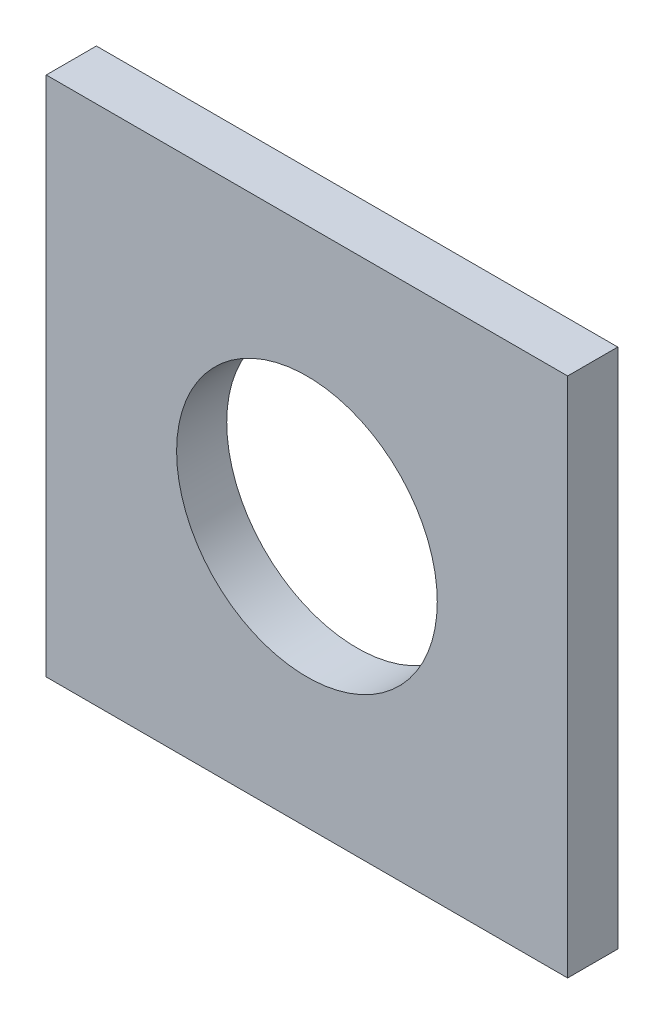
ISO-10303-21;
HEADER;
FILE_DESCRIPTION(('STEP AP214'),'2;1');
FILE_NAME('part.step','',(''),(''),'','','');
FILE_SCHEMA(('AUTOMOTIVE_DESIGN { 1 0 10303 214 1 1 1 1 }'));
ENDSEC;
DATA;
#1=APPLICATION_CONTEXT('core data for automotive mechanical design processes');
#2=APPLICATION_PROTOCOL_DEFINITION('international standard','automotive_design',2000,#1);
#3=PRODUCT_CONTEXT('',#1,'mechanical');
#4=PRODUCT('Part','Part','',(#3));
#5=PRODUCT_RELATED_PRODUCT_CATEGORY('part','',(#4));
#6=PRODUCT_DEFINITION_FORMATION('','',#4);
#7=PRODUCT_DEFINITION_CONTEXT('part definition',#1,'design');
#8=PRODUCT_DEFINITION('design','',#6,#7);
#9=PRODUCT_DEFINITION_SHAPE('','',#8);
#10=(LENGTH_UNIT() NAMED_UNIT(*) SI_UNIT(.MILLI.,.METRE.));
#11=(NAMED_UNIT(*) PLANE_ANGLE_UNIT() SI_UNIT($,.RADIAN.));
#12=(NAMED_UNIT(*) SI_UNIT($,.STERADIAN.) SOLID_ANGLE_UNIT());
#13=UNCERTAINTY_MEASURE_WITH_UNIT(LENGTH_MEASURE(1.E-05),#10,'distance_accuracy_value','');
#14=(GEOMETRIC_REPRESENTATION_CONTEXT(3) GLOBAL_UNCERTAINTY_ASSIGNED_CONTEXT((#13)) GLOBAL_UNIT_ASSIGNED_CONTEXT((#10,
#11,#12)) REPRESENTATION_CONTEXT('',''));
#15=CARTESIAN_POINT('',(0.,0.,0.));
#16=DIRECTION('',(0.,0.,1.));
#17=DIRECTION('',(1.,0.,0.));
#18=AXIS2_PLACEMENT_3D('',#15,#16,#17);
#19=CARTESIAN_POINT('',(0.,0.,7.9375));
#20=DIRECTION('',(0.,0.,-1.));
#21=DIRECTION('',(-1.,0.,0.));
#22=AXIS2_PLACEMENT_3D('',#19,#20,#21);
#23=PLANE('',#22);
#24=DIRECTION('',(0.,1.,0.));
#25=VECTOR('',#24,1.);
#26=CARTESIAN_POINT('',(41.275,-41.275,7.9375));
#27=LINE('',#26,#25);
#28=CARTESIAN_POINT('',(41.275,-41.275,7.9375));
#29=VERTEX_POINT('',#28);
#30=CARTESIAN_POINT('',(41.275,41.275,7.9375));
#31=VERTEX_POINT('',#30);
#32=EDGE_CURVE('E91',#29,#31,#27,.T.);
#33=ORIENTED_EDGE('',*,*,#32,.T.);
#34=DIRECTION('',(-1.,0.,0.));
#35=VECTOR('',#34,1.);
#36=CARTESIAN_POINT('',(-41.275,41.275,7.9375));
#37=LINE('',#36,#35);
#38=CARTESIAN_POINT('',(-41.275,41.275,7.9375));
#39=VERTEX_POINT('',#38);
#40=EDGE_CURVE('E86',#31,#39,#37,.T.);
#41=ORIENTED_EDGE('',*,*,#40,.T.);
#42=DIRECTION('',(0.,-1.,0.));
#43=VECTOR('',#42,1.);
#44=CARTESIAN_POINT('',(-41.275,-41.275,7.9375));
#45=LINE('',#44,#43);
#46=CARTESIAN_POINT('',(-41.275,-41.275,7.9375));
#47=VERTEX_POINT('',#46);
#48=EDGE_CURVE('E89',#39,#47,#45,.T.);
#49=ORIENTED_EDGE('',*,*,#48,.T.);
#50=DIRECTION('',(1.,0.,0.));
#51=VECTOR('',#50,1.);
#52=CARTESIAN_POINT('',(-41.275,-41.275,7.9375));
#53=LINE('',#52,#51);
#54=EDGE_CURVE('E56',#47,#29,#53,.T.);
#55=ORIENTED_EDGE('',*,*,#54,.T.);
#56=EDGE_LOOP('',(#33,#41,#49,#55));
#57=FACE_BOUND('',#56,.T.);
#58=CARTESIAN_POINT('',(0.,0.,7.9375));
#59=DIRECTION('',(0.,0.,1.));
#60=DIRECTION('',(1.,0.,0.));
#61=AXIS2_PLACEMENT_3D('',#58,#59,#60);
#62=CIRCLE('',#61,20.6375);
#63=CARTESIAN_POINT('',(20.6375,0.,7.9375));
#64=VERTEX_POINT('',#63);
#65=EDGE_CURVE('E106',#64,#64,#62,.T.);
#66=ORIENTED_EDGE('',*,*,#65,.F.);
#67=EDGE_LOOP('',(#66));
#68=FACE_BOUND('',#67,.T.);
#69=ADVANCED_FACE('F39',(#57,#68),#23,.F.);
#70=CARTESIAN_POINT('',(0.,0.,0.));
#71=DIRECTION('',(0.,0.,-1.));
#72=DIRECTION('',(-1.,0.,0.));
#73=AXIS2_PLACEMENT_3D('',#70,#71,#72);
#74=PLANE('',#73);
#75=DIRECTION('',(0.,1.,0.));
#76=VECTOR('',#75,1.);
#77=CARTESIAN_POINT('',(41.275,-41.275,0.));
#78=LINE('',#77,#76);
#79=CARTESIAN_POINT('',(41.275,-41.275,0.));
#80=VERTEX_POINT('',#79);
#81=CARTESIAN_POINT('',(41.275,41.275,0.));
#82=VERTEX_POINT('',#81);
#83=EDGE_CURVE('E103',#80,#82,#78,.T.);
#84=ORIENTED_EDGE('',*,*,#83,.F.);
#85=DIRECTION('',(1.,0.,0.));
#86=VECTOR('',#85,1.);
#87=CARTESIAN_POINT('',(-41.275,-41.275,0.));
#88=LINE('',#87,#86);
#89=CARTESIAN_POINT('',(-41.275,-41.275,0.));
#90=VERTEX_POINT('',#89);
#91=EDGE_CURVE('E79',#90,#80,#88,.T.);
#92=ORIENTED_EDGE('',*,*,#91,.F.);
#93=DIRECTION('',(0.,-1.,0.));
#94=VECTOR('',#93,1.);
#95=CARTESIAN_POINT('',(-41.275,-41.275,0.));
#96=LINE('',#95,#94);
#97=CARTESIAN_POINT('',(-41.275,41.275,0.));
#98=VERTEX_POINT('',#97);
#99=EDGE_CURVE('E73',#98,#90,#96,.T.);
#100=ORIENTED_EDGE('',*,*,#99,.F.);
#101=DIRECTION('',(-1.,0.,0.));
#102=VECTOR('',#101,1.);
#103=CARTESIAN_POINT('',(-41.275,41.275,0.));
#104=LINE('',#103,#102);
#105=EDGE_CURVE('E95',#82,#98,#104,.T.);
#106=ORIENTED_EDGE('',*,*,#105,.F.);
#107=EDGE_LOOP('',(#84,#92,#100,#106));
#108=FACE_BOUND('',#107,.T.);
#109=CARTESIAN_POINT('',(0.,0.,0.));
#110=DIRECTION('',(0.,0.,1.));
#111=DIRECTION('',(1.,0.,0.));
#112=AXIS2_PLACEMENT_3D('',#109,#110,#111);
#113=CIRCLE('',#112,20.6375);
#114=CARTESIAN_POINT('',(20.6375,0.,0.));
#115=VERTEX_POINT('',#114);
#116=EDGE_CURVE('E118',#115,#115,#113,.T.);
#117=ORIENTED_EDGE('',*,*,#116,.T.);
#118=EDGE_LOOP('',(#117));
#119=FACE_BOUND('',#118,.T.);
#120=ADVANCED_FACE('F114',(#108,#119),#74,.T.);
#121=CARTESIAN_POINT('',(41.275,-41.275,7.9375));
#122=DIRECTION('',(-1.,0.,0.));
#123=DIRECTION('',(0.,0.,1.));
#124=AXIS2_PLACEMENT_3D('',#121,#122,#123);
#125=PLANE('',#124);
#126=ORIENTED_EDGE('',*,*,#83,.T.);
#127=DIRECTION('',(0.,0.,-1.));
#128=VECTOR('',#127,1.);
#129=CARTESIAN_POINT('',(41.275,41.275,7.9375));
#130=LINE('',#129,#128);
#131=EDGE_CURVE('E11',#31,#82,#130,.T.);
#132=ORIENTED_EDGE('',*,*,#131,.F.);
#133=ORIENTED_EDGE('',*,*,#32,.F.);
#134=DIRECTION('',(0.,0.,-1.));
#135=VECTOR('',#134,1.);
#136=CARTESIAN_POINT('',(41.275,-41.275,7.9375));
#137=LINE('',#136,#135);
#138=EDGE_CURVE('E99',#29,#80,#137,.T.);
#139=ORIENTED_EDGE('',*,*,#138,.T.);
#140=EDGE_LOOP('',(#126,#132,#133,#139));
#141=FACE_BOUND('',#140,.T.);
#142=ADVANCED_FACE('F41',(#141),#125,.F.);
#143=CARTESIAN_POINT('',(-41.275,41.275,7.9375));
#144=DIRECTION('',(0.,-1.,0.));
#145=DIRECTION('',(0.,0.,-1.));
#146=AXIS2_PLACEMENT_3D('',#143,#144,#145);
#147=PLANE('',#146);
#148=ORIENTED_EDGE('',*,*,#105,.T.);
#149=DIRECTION('',(0.,0.,-1.));
#150=VECTOR('',#149,1.);
#151=CARTESIAN_POINT('',(-41.275,41.275,7.9375));
#152=LINE('',#151,#150);
#153=EDGE_CURVE('E48',#39,#98,#152,.T.);
#154=ORIENTED_EDGE('',*,*,#153,.F.);
#155=ORIENTED_EDGE('',*,*,#40,.F.);
#156=ORIENTED_EDGE('',*,*,#131,.T.);
#157=EDGE_LOOP('',(#148,#154,#155,#156));
#158=FACE_BOUND('',#157,.T.);
#159=ADVANCED_FACE('F94',(#158),#147,.F.);
#160=CARTESIAN_POINT('',(-41.275,-41.275,7.9375));
#161=DIRECTION('',(1.,0.,0.));
#162=DIRECTION('',(0.,0.,-1.));
#163=AXIS2_PLACEMENT_3D('',#160,#161,#162);
#164=PLANE('',#163);
#165=ORIENTED_EDGE('',*,*,#99,.T.);
#166=DIRECTION('',(0.,0.,-1.));
#167=VECTOR('',#166,1.);
#168=CARTESIAN_POINT('',(-41.275,-41.275,7.9375));
#169=LINE('',#168,#167);
#170=EDGE_CURVE('E96',#47,#90,#169,.T.);
#171=ORIENTED_EDGE('',*,*,#170,.F.);
#172=ORIENTED_EDGE('',*,*,#48,.F.);
#173=ORIENTED_EDGE('',*,*,#153,.T.);
#174=EDGE_LOOP('',(#165,#171,#172,#173));
#175=FACE_BOUND('',#174,.T.);
#176=ADVANCED_FACE('F97',(#175),#164,.F.);
#177=CARTESIAN_POINT('',(-41.275,-41.275,7.9375));
#178=DIRECTION('',(0.,1.,0.));
#179=DIRECTION('',(0.,0.,1.));
#180=AXIS2_PLACEMENT_3D('',#177,#178,#179);
#181=PLANE('',#180);
#182=ORIENTED_EDGE('',*,*,#91,.T.);
#183=ORIENTED_EDGE('',*,*,#138,.F.);
#184=ORIENTED_EDGE('',*,*,#54,.F.);
#185=ORIENTED_EDGE('',*,*,#170,.T.);
#186=EDGE_LOOP('',(#182,#183,#184,#185));
#187=FACE_BOUND('',#186,.T.);
#188=ADVANCED_FACE('F111',(#187),#181,.F.);
#189=CARTESIAN_POINT('',(0.,0.,7.9375));
#190=DIRECTION('',(0.,0.,-1.));
#191=DIRECTION('',(-1.,0.,0.));
#192=AXIS2_PLACEMENT_3D('',#189,#190,#191);
#193=CYLINDRICAL_SURFACE('',#192,20.6375);
#194=ORIENTED_EDGE('',*,*,#65,.T.);
#195=EDGE_LOOP('',(#194));
#196=FACE_BOUND('',#195,.T.);
#197=ORIENTED_EDGE('',*,*,#116,.F.);
#198=EDGE_LOOP('',(#197));
#199=FACE_BOUND('',#198,.T.);
#200=ADVANCED_FACE('F124',(#196,#199),#193,.F.);
#201=CLOSED_SHELL('',(#69,#120,#142,#159,#176,#188,#200));
#202=MANIFOLD_SOLID_BREP('B2',#201);
#203=ADVANCED_BREP_SHAPE_REPRESENTATION('',(#18,#202),#14);
#204=SHAPE_DEFINITION_REPRESENTATION(#9,#203);
ENDSEC;
END-ISO-10303-21;
